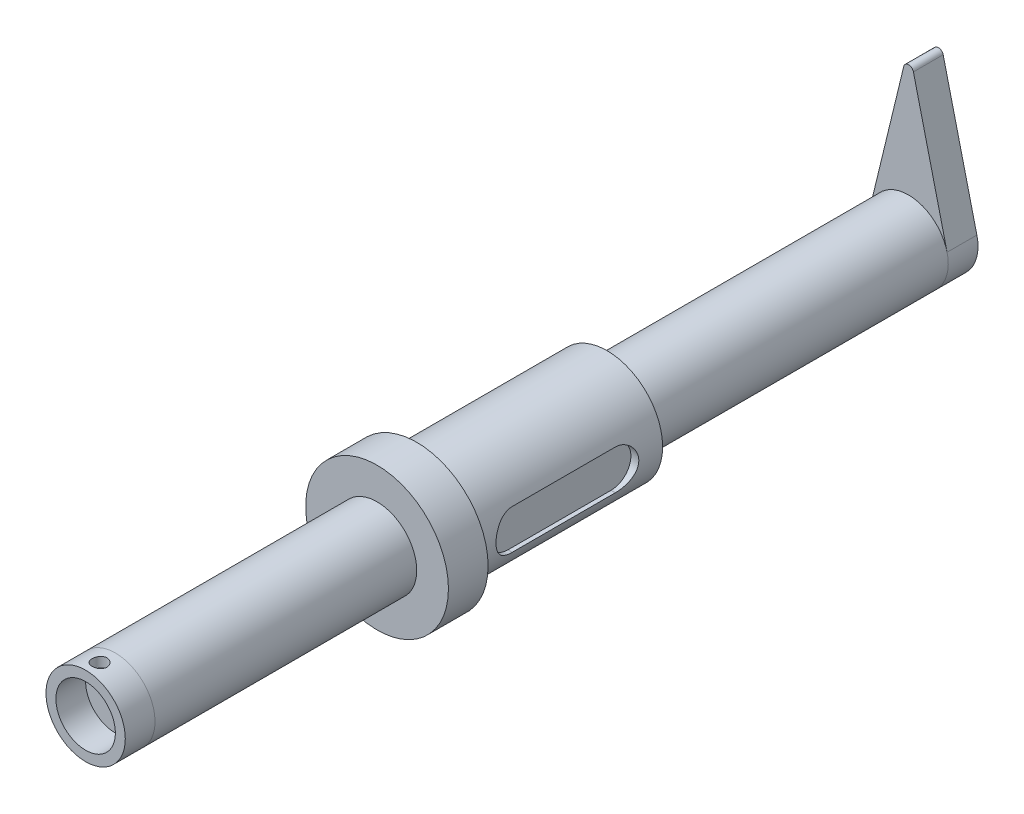
ISO-10303-21;
HEADER;
FILE_DESCRIPTION(('STEP AP214'),'2;1');
FILE_NAME('part.step','',(''),(''),'','','');
FILE_SCHEMA(('AUTOMOTIVE_DESIGN { 1 0 10303 214 1 1 1 1 }'));
ENDSEC;
DATA;
#1=APPLICATION_CONTEXT('core data for automotive mechanical design processes');
#2=APPLICATION_PROTOCOL_DEFINITION('international standard','automotive_design',2000,#1);
#3=PRODUCT_CONTEXT('',#1,'mechanical');
#4=PRODUCT('Part','Part','',(#3));
#5=PRODUCT_RELATED_PRODUCT_CATEGORY('part','',(#4));
#6=PRODUCT_DEFINITION_FORMATION('','',#4);
#7=PRODUCT_DEFINITION_CONTEXT('part definition',#1,'design');
#8=PRODUCT_DEFINITION('design','',#6,#7);
#9=PRODUCT_DEFINITION_SHAPE('','',#8);
#10=(LENGTH_UNIT() NAMED_UNIT(*) SI_UNIT(.MILLI.,.METRE.));
#11=(NAMED_UNIT(*) PLANE_ANGLE_UNIT() SI_UNIT($,.RADIAN.));
#12=(NAMED_UNIT(*) SI_UNIT($,.STERADIAN.) SOLID_ANGLE_UNIT());
#13=UNCERTAINTY_MEASURE_WITH_UNIT(LENGTH_MEASURE(1.E-05),#10,'distance_accuracy_value','');
#14=(GEOMETRIC_REPRESENTATION_CONTEXT(3) GLOBAL_UNCERTAINTY_ASSIGNED_CONTEXT((#13)) GLOBAL_UNIT_ASSIGNED_CONTEXT((#10,
#11,#12)) REPRESENTATION_CONTEXT('',''));
#15=CARTESIAN_POINT('',(0.,0.,0.));
#16=DIRECTION('',(0.,0.,1.));
#17=DIRECTION('',(1.,0.,0.));
#18=AXIS2_PLACEMENT_3D('',#15,#16,#17);
#19=CARTESIAN_POINT('',(0.,0.,43.2436302302761));
#20=DIRECTION('',(0.,0.,-1.));
#21=DIRECTION('',(-1.,0.,0.));
#22=AXIS2_PLACEMENT_3D('',#19,#20,#21);
#23=CYLINDRICAL_SURFACE('',#22,4.);
#24=CARTESIAN_POINT('',(0.,0.,43.2436302302761));
#25=DIRECTION('',(0.,0.,1.));
#26=DIRECTION('',(1.,0.,0.));
#27=AXIS2_PLACEMENT_3D('',#24,#25,#26);
#28=CIRCLE('',#27,4.);
#29=CARTESIAN_POINT('',(4.,0.,43.2436302302761));
#30=VERTEX_POINT('',#29);
#31=EDGE_CURVE('E165',#30,#30,#28,.T.);
#32=ORIENTED_EDGE('',*,*,#31,.F.);
#33=EDGE_LOOP('',(#32));
#34=FACE_BOUND('',#33,.T.);
#35=CARTESIAN_POINT('',(0.,0.,40.2436302302761));
#36=DIRECTION('',(0.,0.,1.));
#37=DIRECTION('',(-0.00112918157534551,-0.999999362474282,0.));
#38=AXIS2_PLACEMENT_3D('',#35,#36,#37);
#39=CIRCLE('',#38,4.);
#40=CARTESIAN_POINT('',(-0.00451672630138206,-3.99999744989713,40.2436302302761));
#41=VERTEX_POINT('',#40);
#42=EDGE_CURVE('E182',#41,#41,#39,.T.);
#43=ORIENTED_EDGE('',*,*,#42,.T.);
#44=EDGE_LOOP('',(#43));
#45=FACE_BOUND('',#44,.T.);
#46=CARTESIAN_POINT('',(0.,4.,41.0927864145834));
#47=CARTESIAN_POINT('',(-0.0417358732327354,3.99999924416926,41.0927880093775));
#48=CARTESIAN_POINT('',(-0.083492496365049,3.99934004960857,41.0962819528931));
#49=CARTESIAN_POINT('',(-0.165829064920899,3.9967739294526,41.1101564121425));
#50=CARTESIAN_POINT('',(-0.206407987076113,3.99486595083448,41.1205427399032));
#51=CARTESIAN_POINT('',(-0.285186480925901,3.99001569382729,41.147872765213));
#52=CARTESIAN_POINT('',(-0.323388165342672,3.98707434973241,41.1648105408096));
#53=CARTESIAN_POINT('',(-0.396403986547004,3.98047855299892,41.2047458530448));
#54=CARTESIAN_POINT('',(-0.431218397238663,3.97682415809145,41.2277428991558));
#55=CARTESIAN_POINT('',(-0.496891857965253,3.96915668215252,41.2794362985852));
#56=CARTESIAN_POINT('',(-0.527704477515916,3.96514017428176,41.3081911369184));
#57=CARTESIAN_POINT('',(-0.584098030676845,3.95722659229325,41.3704580691271));
#58=CARTESIAN_POINT('',(-0.609678588446206,3.95332952677264,41.403970504468));
#59=CARTESIAN_POINT('',(-0.655074993328964,3.94606275622503,41.4751294587653));
#60=CARTESIAN_POINT('',(-0.674843609848028,3.94269746943091,41.512806599742));
#61=CARTESIAN_POINT('',(-0.707752621661417,3.93692356605994,41.5910208721718));
#62=CARTESIAN_POINT('',(-0.720893588565492,3.93451486698481,41.631557756639));
#63=CARTESIAN_POINT('',(-0.740025267517501,3.93096134787275,41.7138440300406));
#64=CARTESIAN_POINT('',(-0.746096950960195,3.92980222683202,41.7555739631851));
#65=CARTESIAN_POINT('',(-0.751169040476732,3.92883598576381,41.8394751069875));
#66=CARTESIAN_POINT('',(-0.75017008067687,3.9290287444938,41.8816462777345));
#67=CARTESIAN_POINT('',(-0.741194898011812,3.93073146350876,41.9646461772164));
#68=CARTESIAN_POINT('',(-0.733310749980225,3.93222404073667,42.0054852717334));
#69=CARTESIAN_POINT('',(-0.710933996981035,3.93633091642333,42.0852506244747));
#70=CARTESIAN_POINT('',(-0.696441111197496,3.93894526254758,42.124176801338));
#71=CARTESIAN_POINT('',(-0.661168235896499,3.94501927646294,42.1992807540835));
#72=CARTESIAN_POINT('',(-0.640351067662281,3.94848391911683,42.2354406498738));
#73=CARTESIAN_POINT('',(-0.593046844652082,3.95586485801459,42.3037887788535));
#74=CARTESIAN_POINT('',(-0.566559214446329,3.95978120007761,42.3359766084408));
#75=CARTESIAN_POINT('',(-0.508169528426487,3.96770000636082,42.3959988924196));
#76=CARTESIAN_POINT('',(-0.476188718430342,3.97170285512015,42.4237567408092));
#77=CARTESIAN_POINT('',(-0.407984018549415,3.97928693054159,42.4735250349211));
#78=CARTESIAN_POINT('',(-0.371760086127885,3.98286815297623,42.4955354230186));
#79=CARTESIAN_POINT('',(-0.296017494437333,3.98921269838754,42.5331952915184));
#80=CARTESIAN_POINT('',(-0.256494782223246,3.99197499568144,42.5488368041423));
#81=CARTESIAN_POINT('',(-0.175319557699348,3.9963625270136,42.5732374611294));
#82=CARTESIAN_POINT('',(-0.133667272138892,3.99798788183997,42.581997336606));
#83=CARTESIAN_POINT('',(-0.0500743264516913,3.9999018032099,42.5922794300925));
#84=CARTESIAN_POINT('',(-0.00814700631706651,4.00020975456139,42.5939066103482));
#85=CARTESIAN_POINT('',(0.0753806240460931,3.99950771799114,42.5901586748095));
#86=CARTESIAN_POINT('',(0.116980950240194,3.99849779482216,42.5847839030507));
#87=CARTESIAN_POINT('',(0.19834078660911,3.99528555750203,42.5672718969917));
#88=CARTESIAN_POINT('',(0.238112130523033,3.99309261187015,42.5551877733145));
#89=CARTESIAN_POINT('',(0.315064315912318,3.98775921106249,42.524657561194));
#90=CARTESIAN_POINT('',(0.352244981297553,3.98461869155667,42.5062110408005));
#91=CARTESIAN_POINT('',(0.423408335756608,3.97769015178833,42.4632473505036));
#92=CARTESIAN_POINT('',(0.457351638507561,3.97389543087281,42.4386660453149));
#93=CARTESIAN_POINT('',(0.520669161632272,3.96609671744856,42.3842173459022));
#94=CARTESIAN_POINT('',(0.550042954880434,3.96209270542343,42.3543494580827));
#95=CARTESIAN_POINT('',(0.60378647936024,3.95426237848725,42.2897002551276));
#96=CARTESIAN_POINT('',(0.628084581092883,3.95043912930128,42.2548589605207));
#97=CARTESIAN_POINT('',(0.670483375288935,3.94346492789266,42.1815276023215));
#98=CARTESIAN_POINT('',(0.688584298069622,3.94031395068675,42.1430376743981));
#99=CARTESIAN_POINT('',(0.717973367564116,3.93506512104787,42.0636834809621));
#100=CARTESIAN_POINT('',(0.729294343973932,3.93296220218439,42.0228317248037));
#101=CARTESIAN_POINT('',(0.744903396631178,3.93003601901208,41.9397628033227));
#102=CARTESIAN_POINT('',(0.749192266353541,3.92921261032895,41.8975457925982));
#103=CARTESIAN_POINT('',(0.750588810741773,3.92894599901929,41.8136622488626));
#104=CARTESIAN_POINT('',(0.747809475017494,3.92948107987147,41.7719976241049));
#105=CARTESIAN_POINT('',(0.735395876894015,3.93182300329999,41.6897407035607));
#106=CARTESIAN_POINT('',(0.72576165544666,3.93362983827873,41.6491484013696));
#107=CARTESIAN_POINT('',(0.699959437916316,3.9383025401159,41.5702491721856));
#108=CARTESIAN_POINT('',(0.683803676986262,3.94116642297482,41.5319381189105));
#109=CARTESIAN_POINT('',(0.645429344561021,3.9476319377592,41.4585522874629));
#110=CARTESIAN_POINT('',(0.623210344740928,3.9512336218006,41.423477738161));
#111=CARTESIAN_POINT('',(0.572947436697675,3.95883633053873,41.3569945745622));
#112=CARTESIAN_POINT('',(0.544821299321517,3.96284252676522,41.3256487082998));
#113=CARTESIAN_POINT('',(0.483713963371147,3.97076416959367,41.2680838333511));
#114=CARTESIAN_POINT('',(0.45073165094581,3.97467959513664,41.2418660040933));
#115=CARTESIAN_POINT('',(0.380492472535939,3.98201987984024,41.1950809382698));
#116=CARTESIAN_POINT('',(0.34319979532026,3.98544000495281,41.174566700338));
#117=CARTESIAN_POINT('',(0.265645056826916,3.99135809690343,41.1401275962808));
#118=CARTESIAN_POINT('',(0.225385825852621,3.99385692939519,41.1261965410599));
#119=CARTESIAN_POINT('',(0.154173601412574,3.99714145353816,41.108147757374));
#120=CARTESIAN_POINT('',(0.123636905125934,3.99820735439103,41.102397099427));
#121=CARTESIAN_POINT('',(0.0620706235575784,3.99963689977005,41.0947158835251));
#122=CARTESIAN_POINT('',(0.0310410508263544,4.00000056214902,41.0927852284554));
#123=CARTESIAN_POINT('',(0.,4.,41.0927864145834));
#124=B_SPLINE_CURVE_WITH_KNOTS('',3,(#46,#47,#48,#49,#50,#51,#52,#53,#54,#55,#56,#57,#58,#59,
#60,#61,#62,#63,#64,#65,#66,#67,#68,#69,#70,#71,#72,#73,#74,#75,#76,#77,#78,#79,#80,#81,#82,#83,
#84,#85,#86,#87,#88,#89,#90,#91,#92,#93,#94,#95,#96,#97,#98,#99,#100,#101,#102,#103,#104,#105,
#106,#107,#108,#109,#110,#111,#112,#113,#114,#115,#116,#117,#118,#119,#120,#121,#122,#123),
.UNSPECIFIED.,.T.,.F.,(4,2,2,2,2,2,2,2,2,2,2,2,2,2,2,2,2,2,2,2,2,2,2,2,2,2,2,2,2,2,2,2,2,2,2,2,
2,2,4),(0.,0.125094100482462,0.250293821267726,0.375380635615454,0.500457326684454,
0.626875590068151,0.753302931418083,0.88073095252179,1.00814798155974,1.13409075722668,
1.26002223793628,1.38429500306383,1.50857304923393,1.63359631314765,1.7586322702493,
1.88563884232038,2.01264668772474,2.1398129416085,2.26696568336873,2.39224087038049,
2.51750990232292,2.64180116953914,2.76610087669016,2.89175889008854,3.01742864206549,
3.1447671849365,3.27210099477473,3.3988131390928,3.52551098473257,3.65019626115875,
3.77488079270753,3.89933248103846,4.02379296327712,4.1501168498319,4.27646975631128,
4.40396024458158,4.53133063465587,4.62437172262205,4.7174104451977),.UNSPECIFIED.);
#125=CARTESIAN_POINT('',(0.,4.,41.0927864145834));
#126=VERTEX_POINT('',#125);
#127=EDGE_CURVE('E289',#126,#126,#124,.T.);
#128=ORIENTED_EDGE('',*,*,#127,.F.);
#129=EDGE_LOOP('',(#128));
#130=FACE_BOUND('',#129,.T.);
#131=ADVANCED_FACE('F43',(#34,#45,#130),#23,.T.);
#132=CARTESIAN_POINT('',(0.,0.,43.2436302302761));
#133=DIRECTION('',(0.,0.,-1.));
#134=DIRECTION('',(-1.,0.,0.));
#135=AXIS2_PLACEMENT_3D('',#132,#133,#134);
#136=CYLINDRICAL_SURFACE('',#135,3.);
#137=CARTESIAN_POINT('',(0.,0.,40.2436302302761));
#138=DIRECTION('',(0.,0.,1.));
#139=DIRECTION('',(1.,0.,0.));
#140=AXIS2_PLACEMENT_3D('',#137,#138,#139);
#141=CIRCLE('',#140,3.);
#142=CARTESIAN_POINT('',(3.,0.,40.2436302302761));
#143=VERTEX_POINT('',#142);
#144=EDGE_CURVE('E11',#143,#143,#141,.F.);
#145=ORIENTED_EDGE('',*,*,#144,.T.);
#146=EDGE_LOOP('',(#145));
#147=FACE_BOUND('',#146,.T.);
#148=CARTESIAN_POINT('',(0.,0.,43.2436302302761));
#149=DIRECTION('',(0.,0.,1.));
#150=DIRECTION('',(1.,0.,0.));
#151=AXIS2_PLACEMENT_3D('',#148,#149,#150);
#152=CIRCLE('',#151,3.);
#153=CARTESIAN_POINT('',(3.,0.,43.2436302302761));
#154=VERTEX_POINT('',#153);
#155=EDGE_CURVE('E296',#154,#154,#152,.T.);
#156=ORIENTED_EDGE('',*,*,#155,.T.);
#157=EDGE_LOOP('',(#156));
#158=FACE_BOUND('',#157,.T.);
#159=CARTESIAN_POINT('',(0.,3.,41.0927864145834));
#160=CARTESIAN_POINT('',(-0.0414380443348658,2.99999929934006,41.0927875774524));
#161=CARTESIAN_POINT('',(-0.0828890789153821,2.99913289065914,41.0962321899703));
#162=CARTESIAN_POINT('',(-0.164603161885267,2.99576056914946,41.1098989902369));
#163=CARTESIAN_POINT('',(-0.20486552343537,2.99325372709984,41.1201250193523));
#164=CARTESIAN_POINT('',(-0.283010436091289,2.9868781316602,41.1470060413144));
#165=CARTESIAN_POINT('',(-0.320895781715002,2.98301101421043,41.163653313941));
#166=CARTESIAN_POINT('',(-0.393336065952214,2.97432671903797,41.2028771096058));
#167=CARTESIAN_POINT('',(-0.42789089217438,2.96950950927025,41.2254538326428));
#168=CARTESIAN_POINT('',(-0.49340096365046,2.95933706795901,41.2763868094105));
#169=CARTESIAN_POINT('',(-0.524277845030536,2.95397353574267,41.304842202063));
#170=CARTESIAN_POINT('',(-0.580874463601652,2.94336810058765,41.3665125170378));
#171=CARTESIAN_POINT('',(-0.606593618474567,2.93812621144174,41.3997279760566));
#172=CARTESIAN_POINT('',(-0.652513271399515,2.92827387849855,41.4705840279521));
#173=CARTESIAN_POINT('',(-0.672626107962677,2.92367397235303,41.5082830299886));
#174=CARTESIAN_POINT('',(-0.706198454275263,2.91574747406112,41.5866606204125));
#175=CARTESIAN_POINT('',(-0.719659027719667,2.91242067836394,41.6273387312462));
#176=CARTESIAN_POINT('',(-0.739277418402146,2.90750238358775,41.7096581636846));
#177=CARTESIAN_POINT('',(-0.74557613416667,2.90587745537713,41.7512638626083));
#178=CARTESIAN_POINT('',(-0.751130887533926,2.90444681268871,41.8349706990904));
#179=CARTESIAN_POINT('',(-0.750388070908989,2.90464080224322,41.8770717549327));
#180=CARTESIAN_POINT('',(-0.741993262319641,2.90679602748309,41.9594943184556));
#181=CARTESIAN_POINT('',(-0.734509170095261,2.9087143150094,41.9998342253159));
#182=CARTESIAN_POINT('',(-0.713112093451553,2.91403354838242,42.078666940039));
#183=CARTESIAN_POINT('',(-0.699198651034711,2.91743459985348,42.1171596160979));
#184=CARTESIAN_POINT('',(-0.665194738968577,2.92537556952093,42.1916554227094));
#185=CARTESIAN_POINT('',(-0.645043333616456,2.92992663734711,42.2276295004781));
#186=CARTESIAN_POINT('',(-0.599178138007477,2.93964855423193,42.2957457694618));
#187=CARTESIAN_POINT('',(-0.573463374404419,2.94481951167368,42.327887288617));
#188=CARTESIAN_POINT('',(-0.516331712340608,2.95537940269891,42.3883882224306));
#189=CARTESIAN_POINT('',(-0.484773129082931,2.96077034738986,42.416613659614));
#190=CARTESIAN_POINT('',(-0.417305958751851,2.97102982789393,42.4673970358153));
#191=CARTESIAN_POINT('',(-0.381397238853971,2.97589834774708,42.4899548017151));
#192=CARTESIAN_POINT('',(-0.306057944340693,2.98458866047091,42.5288117076956));
#193=CARTESIAN_POINT('',(-0.26661569660431,2.98840680063863,42.5450890847106));
#194=CARTESIAN_POINT('',(-0.185438004071439,2.99453958495709,42.5707450674381));
#195=CARTESIAN_POINT('',(-0.14370299957524,2.99685451669641,42.5801249927924));
#196=CARTESIAN_POINT('',(-0.0602699851950113,2.99967749635687,42.5915151973628));
#197=CARTESIAN_POINT('',(-0.0185983599941032,3.00023026754139,42.593707927621));
#198=CARTESIAN_POINT('',(0.0645164374007551,2.99959402407225,42.5911619135556));
#199=CARTESIAN_POINT('',(0.105959629822299,2.99840516620923,42.5864237931838));
#200=CARTESIAN_POINT('',(0.186807134388247,2.99444790563679,42.5703009603877));
#201=CARTESIAN_POINT('',(0.226232559484379,2.99170317092906,42.5590157828449));
#202=CARTESIAN_POINT('',(0.302628646226258,2.98494353317067,42.5302328725691));
#203=CARTESIAN_POINT('',(0.33959905951632,2.98092850184946,42.5127345124268));
#204=CARTESIAN_POINT('',(0.410761567214926,2.97196653963155,42.471668350146));
#205=CARTESIAN_POINT('',(0.444892720917916,2.96700433683466,42.447998358385));
#206=CARTESIAN_POINT('',(0.508763306821623,2.9567225459371,42.3953914601849));
#207=CARTESIAN_POINT('',(0.538501979486506,2.95140289625852,42.3664536447749));
#208=CARTESIAN_POINT('',(0.593495284036368,2.94084478480386,42.3032854341611));
#209=CARTESIAN_POINT('',(0.618621933811018,2.9356115209364,42.2689425630821));
#210=CARTESIAN_POINT('',(0.66275537950635,2.92596439188619,42.1964200973505));
#211=CARTESIAN_POINT('',(0.681762447078969,2.92155049033513,42.1582406731035));
#212=CARTESIAN_POINT('',(0.712975710304647,2.91409047367333,42.0793335533768));
#213=CARTESIAN_POINT('',(0.725222198327034,2.91103627645953,42.0386226004114));
#214=CARTESIAN_POINT('',(0.74267282997689,2.90663372045092,41.9556315956388));
#215=CARTESIAN_POINT('',(0.747878513739329,2.90528498859968,41.9133518890671));
#216=CARTESIAN_POINT('',(0.751019295166997,2.90447450601978,41.8297259026558));
#217=CARTESIAN_POINT('',(0.749158948890059,2.90495966364132,41.788387697021));
#218=CARTESIAN_POINT('',(0.738688639156434,2.90763954503921,41.7066344702494));
#219=CARTESIAN_POINT('',(0.730078811343386,2.90983423445928,41.6662194305765));
#220=CARTESIAN_POINT('',(0.706465659721398,2.91565630341361,41.5876821850507));
#221=CARTESIAN_POINT('',(0.691500702340188,2.91927507618155,41.5495477619633));
#222=CARTESIAN_POINT('',(0.655632456802535,2.92753877862414,41.4763037232265));
#223=CARTESIAN_POINT('',(0.634728345017094,2.93218385060387,41.4411945279899));
#224=CARTESIAN_POINT('',(0.586933874318567,2.94212817131756,41.3740091000823));
#225=CARTESIAN_POINT('',(0.559901581456125,2.94744132415879,41.3420358778714));
#226=CARTESIAN_POINT('',(0.500894685594866,2.95804013623143,41.2830128921857));
#227=CARTESIAN_POINT('',(0.468918910630573,2.9633257886353,41.2559642995269));
#228=CARTESIAN_POINT('',(0.400233793351297,2.97338827823831,41.2070807603011));
#229=CARTESIAN_POINT('',(0.363449211158195,2.97815416682934,41.1853491077476));
#230=CARTESIAN_POINT('',(0.286633029755239,2.98652462487559,41.1484126831131));
#231=CARTESIAN_POINT('',(0.24660378171837,2.99013002599891,41.1332032342591));
#232=CARTESIAN_POINT('',(0.172205126621735,2.99524029782771,41.1120004994185));
#233=CARTESIAN_POINT('',(0.138190085454033,2.99701292526345,41.1048107930567));
#234=CARTESIAN_POINT('',(0.0694530357681406,2.99939302615974,41.0952034427724));
#235=CARTESIAN_POINT('',(0.0347310806213077,3.00000058725447,41.0927854399307));
#236=CARTESIAN_POINT('',(0.,3.,41.0927864145834));
#237=B_SPLINE_CURVE_WITH_KNOTS('',3,(#159,#160,#161,#162,#163,#164,#165,#166,#167,#168,#169,
#170,#171,#172,#173,#174,#175,#176,#177,#178,#179,#180,#181,#182,#183,#184,#185,#186,#187,#188,
#189,#190,#191,#192,#193,#194,#195,#196,#197,#198,#199,#200,#201,#202,#203,#204,#205,#206,#207,
#208,#209,#210,#211,#212,#213,#214,#215,#216,#217,#218,#219,#220,#221,#222,#223,#224,#225,#226,
#227,#228,#229,#230,#231,#232,#233,#234,#235,#236),.UNSPECIFIED.,.T.,.F.,(4,2,2,2,2,2,2,2,2,2,2,
2,2,2,2,2,2,2,2,2,2,2,2,2,2,2,2,2,2,2,2,2,2,2,2,2,2,2,4),(0.,0.124186856235946,0.24844411888195,
0.372552451143054,0.496664970084664,0.623072177185693,0.749493647900307,0.877793237729033,
1.00607230584684,1.13178147549715,1.25747019056348,1.38011248503509,1.50276351733019,
1.6266526393694,1.75056345418081,1.87800750484509,2.00545544779124,2.13334114504557,
2.26120236844321,2.38579154474638,2.51036950556371,2.63310137257019,2.75584563661145,
2.88076793782676,3.00571181504009,3.13372254602238,3.26172759374754,3.38896127307019,
3.51616711626204,3.63971890199306,3.76326820478017,3.88608200279723,4.00891284068451,
4.13494788204955,4.26101284885208,4.38936092749793,4.51761681910675,4.62171121471074,
4.72579778021519),.UNSPECIFIED.);
#238=CARTESIAN_POINT('',(0.,3.,41.0927864145834));
#239=VERTEX_POINT('',#238);
#240=EDGE_CURVE('E47',#239,#239,#237,.T.);
#241=ORIENTED_EDGE('',*,*,#240,.T.);
#242=EDGE_LOOP('',(#241));
#243=FACE_BOUND('',#242,.T.);
#244=ADVANCED_FACE('F264',(#147,#158,#243),#136,.F.);
#245=CARTESIAN_POINT('',(-0.00891774261922876,1.28985864549494E-07,9.8436302302761));
#246=DIRECTION('',(0.,0.,-1.));
#247=DIRECTION('',(-1.,0.,0.));
#248=AXIS2_PLACEMENT_3D('',#245,#246,#247);
#249=CYLINDRICAL_SURFACE('',#248,5.6);
#250=DIRECTION('',(0.,0.,-1.));
#251=VECTOR('',#250,1.);
#252=CARTESIAN_POINT('',(5.22176098962958,2.00000012898587,9.8436302302761));
#253=LINE('',#252,#251);
#254=CARTESIAN_POINT('',(5.22176098962958,2.00000012898587,5.4436302302761));
#255=VERTEX_POINT('',#254);
#256=CARTESIAN_POINT('',(5.22176098962958,2.00000012898587,-4.9563697697239));
#257=VERTEX_POINT('',#256);
#258=EDGE_CURVE('E171',#255,#257,#253,.T.);
#259=ORIENTED_EDGE('',*,*,#258,.T.);
#260=CARTESIAN_POINT('',(5.22176098962958,2.00000012898587,-4.9563697697239));
#261=CARTESIAN_POINT('',(5.22175148766183,2.0000075867531,-5.01068116630704));
#262=CARTESIAN_POINT('',(5.22260665676268,1.99778800959942,-5.06498731583517));
#263=CARTESIAN_POINT('',(5.22597551720584,1.98895294593115,-5.17317289821303));
#264=CARTESIAN_POINT('',(5.22848870072527,1.98233880539553,-5.2270524566088));
#265=CARTESIAN_POINT('',(5.23509199848431,1.96480153127306,-5.33382690140613));
#266=CARTESIAN_POINT('',(5.23917691102618,1.95389260869751,-5.38672443879575));
#267=CARTESIAN_POINT('',(5.24878768021417,1.92788105271905,-5.49133123781068));
#268=CARTESIAN_POINT('',(5.25431360058674,1.91277823384535,-5.54304044677384));
#269=CARTESIAN_POINT('',(5.27280173230645,1.8613918424195,-5.69578126290591));
#270=CARTESIAN_POINT('',(5.28768606010753,1.81900102984175,-5.79460213143236));
#271=CARTESIAN_POINT('',(5.32088543626645,1.71928619190927,-5.98375403622628));
#272=CARTESIAN_POINT('',(5.33920298077978,1.66195128937666,-6.07407882311232));
#273=CARTESIAN_POINT('',(5.37812156771856,1.53122069780163,-6.24774194040607));
#274=CARTESIAN_POINT('',(5.39878516971174,1.45726682615982,-6.3306469498806));
#275=CARTESIAN_POINT('',(5.43954299596502,1.29658723919651,-6.48317673349704));
#276=CARTESIAN_POINT('',(5.45963711353971,1.20985914940725,-6.55279903311858));
#277=CARTESIAN_POINT('',(5.49773132361314,1.02283145167334,-6.67884165408789));
#278=CARTESIAN_POINT('',(5.51564893917114,0.922198799299348,-6.73479498721233));
#279=CARTESIAN_POINT('',(5.54662111876184,0.712200789367175,-6.82879908716182));
#280=CARTESIAN_POINT('',(5.55967735006449,0.602838441418128,-6.86685599296071));
#281=CARTESIAN_POINT('',(5.57901066146646,0.383064112390807,-6.92248225146979));
#282=CARTESIAN_POINT('',(5.58553501220089,0.27286399716784,-6.94080107410076));
#283=CARTESIAN_POINT('',(5.59195264181135,0.0507715732233893,-6.95882449194601));
#284=CARTESIAN_POINT('',(5.59184775580239,-0.0611202586200921,-6.95853423855162));
#285=CARTESIAN_POINT('',(5.58518032177339,-0.27807447780369,-6.939800750715));
#286=CARTESIAN_POINT('',(5.5789082060489,-0.38321779667711,-6.92217393436508));
#287=CARTESIAN_POINT('',(5.56098491743955,-0.588940520729019,-6.87063103039686));
#288=CARTESIAN_POINT('',(5.54933344057307,-0.689519667638505,-6.83671402223388));
#289=CARTESIAN_POINT('',(5.52161431250372,-0.884928690452592,-6.75313224047164));
#290=CARTESIAN_POINT('',(5.50548699469528,-0.979658103549383,-6.7032531977558));
#291=CARTESIAN_POINT('',(5.47046910231133,-1.15962812145832,-6.58934630154521));
#292=CARTESIAN_POINT('',(5.45157768905488,-1.2448658324283,-6.52531415069702));
#293=CARTESIAN_POINT('',(5.41180663982469,-1.40825943306269,-6.38091115879854));
#294=CARTESIAN_POINT('',(5.39087470413177,-1.48579335661748,-6.29984999120798));
#295=CARTESIAN_POINT('',(5.35020499713257,-1.62639918798451,-6.12570787839144));
#296=CARTESIAN_POINT('',(5.33046765550283,-1.68946591466583,-6.03262264558912));
#297=CARTESIAN_POINT('',(5.29410468838401,-1.8003987582018,-5.83481569090632));
#298=CARTESIAN_POINT('',(5.27754525833273,-1.84795353493114,-5.72990658931957));
#299=CARTESIAN_POINT('',(5.25018796626291,-1.92444338882093,-5.51287792845815));
#300=CARTESIAN_POINT('',(5.2393807147012,-1.95340882621377,-5.40077045678871));
#301=CARTESIAN_POINT('',(5.22875059534527,-1.98164384820315,-5.23234533431253));
#302=CARTESIAN_POINT('',(5.22613834512403,-1.9885226517057,-5.17738072830647));
#303=CARTESIAN_POINT('',(5.22264154401818,-1.99769868841319,-5.06707763837055));
#304=CARTESIAN_POINT('',(5.22175508250825,-2.00000098833707,-5.01173963604349));
#305=CARTESIAN_POINT('',(5.22176098962958,-1.99999987101413,-4.9563697697239));
#306=B_SPLINE_CURVE_WITH_KNOTS('',3,(#260,#261,#262,#263,#264,#265,#266,#267,#268,#269,#270,
#271,#272,#273,#274,#275,#276,#277,#278,#279,#280,#281,#282,#283,#284,#285,#286,#287,#288,#289,
#290,#291,#292,#293,#294,#295,#296,#297,#298,#299,#300,#301,#302,#303,#304,#305),.UNSPECIFIED.,
.F.,.F.,(4,2,2,2,2,2,2,2,2,2,2,2,2,2,2,2,2,2,2,2,2,2,4),(0.,0.162873302841272,0.325696743380423,
0.487985885236594,0.650282205308792,0.974344948444097,1.29864422518776,1.63612777849544,
1.97367414249472,2.32150719172449,2.6692208373219,3.00320795152689,3.33710261133538,
3.65599136689078,3.9748981446951,4.29827927558912,4.62175873094338,4.96252670356071,
5.30341652539777,5.65077863246804,5.99757197193956,6.16374864130218,6.32974123117123),.UNSPECIFIED.);
#307=CARTESIAN_POINT('',(5.22176098962958,-1.99999987101413,-4.9563697697239));
#308=VERTEX_POINT('',#307);
#309=EDGE_CURVE('E230',#257,#308,#306,.T.);
#310=ORIENTED_EDGE('',*,*,#309,.T.);
#311=DIRECTION('',(0.,0.,-1.));
#312=VECTOR('',#311,1.);
#313=CARTESIAN_POINT('',(5.22176098962958,-1.99999987101414,9.8436302302761));
#314=LINE('',#313,#312);
#315=CARTESIAN_POINT('',(5.22176098962958,-1.99999987101414,5.4436302302761));
#316=VERTEX_POINT('',#315);
#317=EDGE_CURVE('E217',#308,#316,#314,.F.);
#318=ORIENTED_EDGE('',*,*,#317,.T.);
#319=CARTESIAN_POINT('',(5.22176098962958,-1.99999987101414,5.4436302302761));
#320=CARTESIAN_POINT('',(5.22175148766183,-2.00000732878136,5.49794162685925));
#321=CARTESIAN_POINT('',(5.22260665676268,-1.99778775162769,5.55224777638737));
#322=CARTESIAN_POINT('',(5.22597551720584,-1.98895268795942,5.66043335876524));
#323=CARTESIAN_POINT('',(5.22848870072527,-1.9823385474238,5.71431291716101));
#324=CARTESIAN_POINT('',(5.23509199848431,-1.96480127330133,5.82108736195833));
#325=CARTESIAN_POINT('',(5.23917691102618,-1.95389235072577,5.87398489934795));
#326=CARTESIAN_POINT('',(5.24878768021417,-1.92788079474732,5.97859169836288));
#327=CARTESIAN_POINT('',(5.25431360058674,-1.91277797587362,6.03030090732604));
#328=CARTESIAN_POINT('',(5.27280173230645,-1.86139158444777,6.18304172345812));
#329=CARTESIAN_POINT('',(5.28768606010753,-1.81900077187002,6.28186259198456));
#330=CARTESIAN_POINT('',(5.32088543626645,-1.71928593393753,6.47101449677848));
#331=CARTESIAN_POINT('',(5.33920298077978,-1.66195103140493,6.56133928366453));
#332=CARTESIAN_POINT('',(5.37812156771856,-1.53122043982989,6.73500240095828));
#333=CARTESIAN_POINT('',(5.39878516971174,-1.45726656818809,6.81790741043281));
#334=CARTESIAN_POINT('',(5.43954299596502,-1.29658698122478,6.97043719404924));
#335=CARTESIAN_POINT('',(5.45963711353971,-1.20985889143552,7.04005949367079));
#336=CARTESIAN_POINT('',(5.49773132361314,-1.02283119370161,7.16610211464009));
#337=CARTESIAN_POINT('',(5.51564893917114,-0.922198541327615,7.22205544776454));
#338=CARTESIAN_POINT('',(5.54662111876184,-0.712200531395443,7.31605954771403));
#339=CARTESIAN_POINT('',(5.5596773500645,-0.602838183446396,7.35411645351291));
#340=CARTESIAN_POINT('',(5.57901066146646,-0.383063854419075,7.409742712022));
#341=CARTESIAN_POINT('',(5.58553501220089,-0.272863739196108,7.42806153465297));
#342=CARTESIAN_POINT('',(5.59195264181135,-0.0507713152516576,7.44608495249822));
#343=CARTESIAN_POINT('',(5.59184775580239,0.061120516591824,7.44579469910383));
#344=CARTESIAN_POINT('',(5.58518032177339,0.278074735775422,7.42706121126721));
#345=CARTESIAN_POINT('',(5.5789082060489,0.383218054648842,7.40943439491728));
#346=CARTESIAN_POINT('',(5.56098491743955,0.588940778700752,7.35789149094906));
#347=CARTESIAN_POINT('',(5.54933344057307,0.689519925610237,7.32397448278609));
#348=CARTESIAN_POINT('',(5.52161431250372,0.884928948424324,7.24039270102385));
#349=CARTESIAN_POINT('',(5.50548699469528,0.979658361521115,7.19051365830801));
#350=CARTESIAN_POINT('',(5.47046910231133,1.15962837943005,7.07660676209742));
#351=CARTESIAN_POINT('',(5.45157768905488,1.24486609040003,7.01257461124923));
#352=CARTESIAN_POINT('',(5.41180663982469,1.40825969103443,6.86817161935074));
#353=CARTESIAN_POINT('',(5.39087470413177,1.48579361458921,6.78711045176019));
#354=CARTESIAN_POINT('',(5.35020499713257,1.62639944595624,6.61296833894365));
#355=CARTESIAN_POINT('',(5.33046765550282,1.68946617263756,6.51988310614133));
#356=CARTESIAN_POINT('',(5.29410468838401,1.80039901617354,6.32207615145852));
#357=CARTESIAN_POINT('',(5.27754525833273,1.84795379290287,6.21716704987177));
#358=CARTESIAN_POINT('',(5.25018796626291,1.92444364679266,6.00013838901035));
#359=CARTESIAN_POINT('',(5.2393807147012,1.9534090841855,5.88803091734092));
#360=CARTESIAN_POINT('',(5.22875059534527,1.98164410617488,5.71960579486473));
#361=CARTESIAN_POINT('',(5.22613834512403,1.98852290967743,5.66464118885867));
#362=CARTESIAN_POINT('',(5.22264154401818,1.99769894638492,5.55433809892275));
#363=CARTESIAN_POINT('',(5.22175508250825,2.0000012463088,5.49900009659569));
#364=CARTESIAN_POINT('',(5.22176098962958,2.00000012898587,5.4436302302761));
#365=B_SPLINE_CURVE_WITH_KNOTS('',3,(#319,#320,#321,#322,#323,#324,#325,#326,#327,#328,#329,
#330,#331,#332,#333,#334,#335,#336,#337,#338,#339,#340,#341,#342,#343,#344,#345,#346,#347,#348,
#349,#350,#351,#352,#353,#354,#355,#356,#357,#358,#359,#360,#361,#362,#363,#364),.UNSPECIFIED.,
.F.,.F.,(4,2,2,2,2,2,2,2,2,2,2,2,2,2,2,2,2,2,2,2,2,2,4),(0.,0.162873302841273,0.325696743380424,
0.487985885236594,0.650282205308792,0.974344948444097,1.29864422518776,1.63612777849544,
1.97367414249472,2.32150719172449,2.6692208373219,3.00320795152689,3.33710261133538,
3.65599136689078,3.9748981446951,4.29827927558912,4.62175873094337,4.96252670356071,
5.30341652539777,5.65077863246804,5.99757197193956,6.16374864130219,6.32974123117123),.UNSPECIFIED.);
#366=EDGE_CURVE('E221',#316,#255,#365,.T.);
#367=ORIENTED_EDGE('',*,*,#366,.T.);
#368=EDGE_LOOP('',(#259,#310,#318,#367));
#369=FACE_BOUND('',#368,.T.);
#370=CARTESIAN_POINT('',(-0.00891774261922876,1.28985864549494E-07,9.8436302302761));
#371=DIRECTION('',(0.,0.,1.));
#372=DIRECTION('',(1.,0.,0.));
#373=AXIS2_PLACEMENT_3D('',#370,#371,#372);
#374=CIRCLE('',#373,5.6);
#375=CARTESIAN_POINT('',(5.59108225738077,1.28985864549494E-07,9.8436302302761));
#376=VERTEX_POINT('',#375);
#377=EDGE_CURVE('E329',#376,#376,#374,.T.);
#378=ORIENTED_EDGE('',*,*,#377,.F.);
#379=EDGE_LOOP('',(#378));
#380=FACE_BOUND('',#379,.T.);
#381=CARTESIAN_POINT('',(-0.00891774261922876,1.28985864549494E-07,-9.3563697697239));
#382=DIRECTION('',(0.,0.,1.));
#383=DIRECTION('',(1.,0.,0.));
#384=AXIS2_PLACEMENT_3D('',#381,#382,#383);
#385=CIRCLE('',#384,5.6);
#386=CARTESIAN_POINT('',(5.59108225738077,1.28985864549494E-07,-9.3563697697239));
#387=VERTEX_POINT('',#386);
#388=EDGE_CURVE('E407',#387,#387,#385,.T.);
#389=ORIENTED_EDGE('',*,*,#388,.T.);
#390=EDGE_LOOP('',(#389));
#391=FACE_BOUND('',#390,.T.);
#392=ADVANCED_FACE('F237',(#369,#380,#391),#249,.T.);
#393=CARTESIAN_POINT('',(-0.00891774261922876,1.28985864549494E-07,-9.3563697697239));
#394=DIRECTION('',(0.,0.,1.));
#395=DIRECTION('',(1.,0.,0.));
#396=AXIS2_PLACEMENT_3D('',#393,#394,#395);
#397=PLANE('',#396);
#398=CARTESIAN_POINT('',(-0.00891774261922876,1.28985864549494E-07,-9.3563697697239));
#399=DIRECTION('',(0.,0.,1.));
#400=DIRECTION('',(1.,0.,0.));
#401=AXIS2_PLACEMENT_3D('',#398,#399,#400);
#402=CIRCLE('',#401,4.);
#403=CARTESIAN_POINT('',(3.99108225738077,1.28985864549494E-07,-9.3563697697239));
#404=VERTEX_POINT('',#403);
#405=EDGE_CURVE('E411',#404,#404,#402,.T.);
#406=ORIENTED_EDGE('',*,*,#405,.T.);
#407=EDGE_LOOP('',(#406));
#408=FACE_BOUND('',#407,.T.);
#409=ORIENTED_EDGE('',*,*,#388,.F.);
#410=EDGE_LOOP('',(#409));
#411=FACE_BOUND('',#410,.T.);
#412=ADVANCED_FACE('F257',(#408,#411),#397,.F.);
#413=CARTESIAN_POINT('',(-0.00891774261922876,1.28985864549494E-07,40.2436302302761));
#414=DIRECTION('',(0.,0.,-1.));
#415=DIRECTION('',(-1.,0.,0.));
#416=AXIS2_PLACEMENT_3D('',#413,#414,#415);
#417=CYLINDRICAL_SURFACE('',#416,4.);
#418=CARTESIAN_POINT('',(-0.00891774261922876,1.28985864549494E-07,-39.7563697697239));
#419=DIRECTION('',(0.,0.,1.));
#420=DIRECTION('',(0.972072995611254,0.234678697804814,0.));
#421=AXIS2_PLACEMENT_3D('',#418,#419,#420);
#422=CIRCLE('',#421,4.);
#423=CARTESIAN_POINT('',(3.88332775454099,0.939873771797381,-39.7563697697239));
#424=VERTEX_POINT('',#423);
#425=CARTESIAN_POINT('',(-3.89223265085791,0.942281572301635,-39.7563697697239));
#426=VERTEX_POINT('',#425);
#427=EDGE_CURVE('E213',#424,#426,#422,.T.);
#428=ORIENTED_EDGE('',*,*,#427,.T.);
#429=CARTESIAN_POINT('',(0.,0.,-39.7563697697239));
#430=DIRECTION('',(0.,0.,-1.));
#431=DIRECTION('',(0.971924214227013,0.235294117646838,0.));
#432=AXIS2_PLACEMENT_3D('',#429,#430,#431);
#433=CIRCLE('',#432,3.99999999999625);
#434=EDGE_CURVE('E164',#424,#426,#433,.T.);
#435=ORIENTED_EDGE('',*,*,#434,.F.);
#436=EDGE_LOOP('',(#428,#435));
#437=FACE_BOUND('',#436,.T.);
#438=ORIENTED_EDGE('',*,*,#405,.F.);
#439=EDGE_LOOP('',(#438));
#440=FACE_BOUND('',#439,.T.);
#441=ADVANCED_FACE('F197',(#437,#440),#417,.T.);
#442=CARTESIAN_POINT('',(-0.00891774261922876,1.28985864549494E-07,13.8436302302761));
#443=DIRECTION('',(0.,0.,-1.));
#444=DIRECTION('',(-1.,0.,0.));
#445=AXIS2_PLACEMENT_3D('',#442,#443,#444);
#446=CYLINDRICAL_SURFACE('',#445,7.2);
#447=CARTESIAN_POINT('',(-0.00891774261922876,1.28985864549494E-07,13.8436302302761));
#448=DIRECTION('',(0.,0.,1.));
#449=DIRECTION('',(1.,0.,0.));
#450=AXIS2_PLACEMENT_3D('',#447,#448,#449);
#451=CIRCLE('',#450,7.2);
#452=CARTESIAN_POINT('',(7.19108225738077,1.28985864549494E-07,13.8436302302761));
#453=VERTEX_POINT('',#452);
#454=EDGE_CURVE('E396',#453,#453,#451,.T.);
#455=ORIENTED_EDGE('',*,*,#454,.F.);
#456=EDGE_LOOP('',(#455));
#457=FACE_BOUND('',#456,.T.);
#458=CARTESIAN_POINT('',(-0.00891774261922876,1.28985864549494E-07,9.8436302302761));
#459=DIRECTION('',(0.,0.,1.));
#460=DIRECTION('',(1.,0.,0.));
#461=AXIS2_PLACEMENT_3D('',#458,#459,#460);
#462=CIRCLE('',#461,7.2);
#463=CARTESIAN_POINT('',(7.19108225738077,1.28985864549494E-07,9.8436302302761));
#464=VERTEX_POINT('',#463);
#465=EDGE_CURVE('E392',#464,#464,#462,.T.);
#466=ORIENTED_EDGE('',*,*,#465,.T.);
#467=EDGE_LOOP('',(#466));
#468=FACE_BOUND('',#467,.T.);
#469=ADVANCED_FACE('F250',(#457,#468),#446,.T.);
#470=CARTESIAN_POINT('',(-0.00891774261922876,1.28985864549494E-07,13.8436302302761));
#471=DIRECTION('',(0.,0.,1.));
#472=DIRECTION('',(1.,0.,0.));
#473=AXIS2_PLACEMENT_3D('',#470,#471,#472);
#474=PLANE('',#473);
#475=CARTESIAN_POINT('',(-0.00891774261922876,1.28985864549494E-07,13.8436302302761));
#476=DIRECTION('',(0.,0.,1.));
#477=DIRECTION('',(1.,0.,0.));
#478=AXIS2_PLACEMENT_3D('',#475,#476,#477);
#479=CIRCLE('',#478,4.);
#480=CARTESIAN_POINT('',(3.99108225738077,1.28985864549494E-07,13.8436302302761));
#481=VERTEX_POINT('',#480);
#482=EDGE_CURVE('E400',#481,#481,#479,.T.);
#483=ORIENTED_EDGE('',*,*,#482,.F.);
#484=EDGE_LOOP('',(#483));
#485=FACE_BOUND('',#484,.T.);
#486=ORIENTED_EDGE('',*,*,#454,.T.);
#487=EDGE_LOOP('',(#486));
#488=FACE_BOUND('',#487,.T.);
#489=ADVANCED_FACE('F247',(#485,#488),#474,.T.);
#490=CARTESIAN_POINT('',(-0.00891774261922876,1.28985864549494E-07,9.8436302302761));
#491=DIRECTION('',(0.,0.,1.));
#492=DIRECTION('',(1.,0.,0.));
#493=AXIS2_PLACEMENT_3D('',#490,#491,#492);
#494=PLANE('',#493);
#495=ORIENTED_EDGE('',*,*,#377,.T.);
#496=EDGE_LOOP('',(#495));
#497=FACE_BOUND('',#496,.T.);
#498=ORIENTED_EDGE('',*,*,#465,.F.);
#499=EDGE_LOOP('',(#498));
#500=FACE_BOUND('',#499,.T.);
#501=ADVANCED_FACE('F195',(#497,#500),#494,.F.);
#502=ORIENTED_EDGE('',*,*,#482,.T.);
#503=EDGE_LOOP('',(#502));
#504=FACE_BOUND('',#503,.T.);
#505=ORIENTED_EDGE('',*,*,#42,.F.);
#506=EDGE_LOOP('',(#505));
#507=FACE_BOUND('',#506,.T.);
#508=ADVANCED_FACE('F185',(#504,#507),#417,.T.);
#509=CARTESIAN_POINT('',(4.79108225738077,1.28985864549494E-07,5.4436302302761));
#510=DIRECTION('',(1.,0.,0.));
#511=DIRECTION('',(0.,0.,-1.));
#512=AXIS2_PLACEMENT_3D('',#509,#510,#511);
#513=CYLINDRICAL_SURFACE('',#512,2.);
#514=DIRECTION('',(1.,0.,0.));
#515=VECTOR('',#514,1.);
#516=CARTESIAN_POINT('',(4.79108225738077,-1.99999987101414,5.4436302302761));
#517=LINE('',#516,#515);
#518=CARTESIAN_POINT('',(4.79108225738077,-1.99999987101414,5.4436302302761));
#519=VERTEX_POINT('',#518);
#520=EDGE_CURVE('E385',#519,#316,#517,.T.);
#521=ORIENTED_EDGE('',*,*,#520,.F.);
#522=CARTESIAN_POINT('',(4.79108225738077,1.28985864549494E-07,5.4436302302761));
#523=DIRECTION('',(1.,0.,0.));
#524=DIRECTION('',(0.,0.,-1.));
#525=AXIS2_PLACEMENT_3D('',#522,#523,#524);
#526=CIRCLE('',#525,2.);
#527=CARTESIAN_POINT('',(4.79108225738077,2.00000012898587,5.4436302302761));
#528=VERTEX_POINT('',#527);
#529=EDGE_CURVE('E142',#528,#519,#526,.T.);
#530=ORIENTED_EDGE('',*,*,#529,.F.);
#531=DIRECTION('',(1.,0.,0.));
#532=VECTOR('',#531,1.);
#533=CARTESIAN_POINT('',(4.79108225738077,2.00000012898587,5.4436302302761));
#534=LINE('',#533,#532);
#535=EDGE_CURVE('E374',#528,#255,#534,.T.);
#536=ORIENTED_EDGE('',*,*,#535,.T.);
#537=ORIENTED_EDGE('',*,*,#366,.F.);
#538=EDGE_LOOP('',(#521,#530,#536,#537));
#539=FACE_BOUND('',#538,.T.);
#540=ADVANCED_FACE('F194',(#539),#513,.F.);
#541=CARTESIAN_POINT('',(4.79108225738077,2.00000012898587,5.4436302302761));
#542=DIRECTION('',(0.,1.,0.));
#543=DIRECTION('',(0.,0.,1.));
#544=AXIS2_PLACEMENT_3D('',#541,#542,#543);
#545=PLANE('',#544);
#546=ORIENTED_EDGE('',*,*,#535,.F.);
#547=DIRECTION('',(0.,0.,1.));
#548=VECTOR('',#547,1.);
#549=CARTESIAN_POINT('',(4.79108225738077,2.00000012898587,5.4436302302761));
#550=LINE('',#549,#548);
#551=CARTESIAN_POINT('',(4.79108225738077,2.00000012898587,-4.9563697697239));
#552=VERTEX_POINT('',#551);
#553=EDGE_CURVE('E378',#552,#528,#550,.T.);
#554=ORIENTED_EDGE('',*,*,#553,.F.);
#555=DIRECTION('',(1.,0.,0.));
#556=VECTOR('',#555,1.);
#557=CARTESIAN_POINT('',(4.79108225738077,2.00000012898587,-4.9563697697239));
#558=LINE('',#557,#556);
#559=EDGE_CURVE('E366',#552,#257,#558,.T.);
#560=ORIENTED_EDGE('',*,*,#559,.T.);
#561=ORIENTED_EDGE('',*,*,#258,.F.);
#562=EDGE_LOOP('',(#546,#554,#560,#561));
#563=FACE_BOUND('',#562,.T.);
#564=ADVANCED_FACE('F244',(#563),#545,.F.);
#565=CARTESIAN_POINT('',(4.79108225738077,1.28985866459943E-07,-4.9563697697239));
#566=DIRECTION('',(1.,0.,0.));
#567=DIRECTION('',(0.,0.,-1.));
#568=AXIS2_PLACEMENT_3D('',#565,#566,#567);
#569=CYLINDRICAL_SURFACE('',#568,2.);
#570=ORIENTED_EDGE('',*,*,#559,.F.);
#571=CARTESIAN_POINT('',(4.79108225738077,1.28985866459943E-07,-4.9563697697239));
#572=DIRECTION('',(1.,0.,0.));
#573=DIRECTION('',(0.,0.,-1.));
#574=AXIS2_PLACEMENT_3D('',#571,#572,#573);
#575=CIRCLE('',#574,2.);
#576=CARTESIAN_POINT('',(4.79108225738077,-1.99999987101413,-4.9563697697239));
#577=VERTEX_POINT('',#576);
#578=EDGE_CURVE('E369',#577,#552,#575,.T.);
#579=ORIENTED_EDGE('',*,*,#578,.F.);
#580=DIRECTION('',(1.,0.,0.));
#581=VECTOR('',#580,1.);
#582=CARTESIAN_POINT('',(4.79108225738077,-1.99999987101413,-4.9563697697239));
#583=LINE('',#582,#581);
#584=EDGE_CURVE('E375',#577,#308,#583,.T.);
#585=ORIENTED_EDGE('',*,*,#584,.T.);
#586=ORIENTED_EDGE('',*,*,#309,.F.);
#587=EDGE_LOOP('',(#570,#579,#585,#586));
#588=FACE_BOUND('',#587,.T.);
#589=ADVANCED_FACE('F355',(#588),#569,.F.);
#590=CARTESIAN_POINT('',(4.79108225738077,-1.99999987101414,5.4436302302761));
#591=DIRECTION('',(0.,-1.,0.));
#592=DIRECTION('',(0.,0.,-1.));
#593=AXIS2_PLACEMENT_3D('',#590,#591,#592);
#594=PLANE('',#593);
#595=ORIENTED_EDGE('',*,*,#584,.F.);
#596=DIRECTION('',(0.,0.,-1.));
#597=VECTOR('',#596,1.);
#598=CARTESIAN_POINT('',(4.79108225738077,-1.99999987101414,5.4436302302761));
#599=LINE('',#598,#597);
#600=EDGE_CURVE('E147',#519,#577,#599,.T.);
#601=ORIENTED_EDGE('',*,*,#600,.F.);
#602=ORIENTED_EDGE('',*,*,#520,.T.);
#603=ORIENTED_EDGE('',*,*,#317,.F.);
#604=EDGE_LOOP('',(#595,#601,#602,#603));
#605=FACE_BOUND('',#604,.T.);
#606=ADVANCED_FACE('F246',(#605),#594,.F.);
#607=CARTESIAN_POINT('',(4.79108225738077,1.28985864549494E-07,5.4436302302761));
#608=DIRECTION('',(1.,0.,0.));
#609=DIRECTION('',(0.,0.,-1.));
#610=AXIS2_PLACEMENT_3D('',#607,#608,#609);
#611=PLANE('',#610);
#612=ORIENTED_EDGE('',*,*,#529,.T.);
#613=ORIENTED_EDGE('',*,*,#600,.T.);
#614=ORIENTED_EDGE('',*,*,#578,.T.);
#615=ORIENTED_EDGE('',*,*,#553,.T.);
#616=EDGE_LOOP('',(#612,#613,#614,#615));
#617=FACE_BOUND('',#616,.T.);
#618=ADVANCED_FACE('F344',(#617),#611,.T.);
#619=CARTESIAN_POINT('',(0.,0.,-39.7563697697239));
#620=DIRECTION('',(0.,0.,-1.));
#621=DIRECTION('',(-1.,0.,0.));
#622=AXIS2_PLACEMENT_3D('',#619,#620,#621);
#623=PLANE('',#622);
#624=DIRECTION('',(0.235294117646838,-0.971924214227013,0.));
#625=VECTOR('',#624,1.);
#626=CARTESIAN_POINT('',(0.,17.,-39.7563697697239));
#627=LINE('',#626,#625);
#628=CARTESIAN_POINT('',(0.485962107113507,14.9926470588214,-39.7563697697239));
#629=VERTEX_POINT('',#628);
#630=EDGE_CURVE('E140',#629,#424,#627,.T.);
#631=ORIENTED_EDGE('',*,*,#630,.F.);
#632=CARTESIAN_POINT('',(0.,14.874999999998,-39.7563697697239));
#633=DIRECTION('',(0.,0.,-1.));
#634=DIRECTION('',(-1.,0.,0.));
#635=AXIS2_PLACEMENT_3D('',#632,#633,#634);
#636=CIRCLE('',#635,0.5);
#637=CARTESIAN_POINT('',(-0.485962107113506,14.9926470588214,-39.7563697697239));
#638=VERTEX_POINT('',#637);
#639=EDGE_CURVE('E73',#629,#638,#636,.F.);
#640=ORIENTED_EDGE('',*,*,#639,.T.);
#641=DIRECTION('',(0.235294117646838,0.971924214227013,0.));
#642=VECTOR('',#641,1.);
#643=CARTESIAN_POINT('',(-3.8876968569044,0.941176470586469,-39.7563697697239));
#644=LINE('',#643,#642);
#645=EDGE_CURVE('E127',#426,#638,#644,.T.);
#646=ORIENTED_EDGE('',*,*,#645,.F.);
#647=ORIENTED_EDGE('',*,*,#427,.F.);
#648=EDGE_LOOP('',(#631,#640,#646,#647));
#649=FACE_BOUND('',#648,.T.);
#650=ADVANCED_FACE('F326',(#649),#623,.F.);
#651=CARTESIAN_POINT('',(0.,17.,-42.7563697697239));
#652=DIRECTION('',(-0.971924214227012,-0.235294117646838,0.));
#653=DIRECTION('',(0.235294117646838,-0.971924214227013,0.));
#654=AXIS2_PLACEMENT_3D('',#651,#652,#653);
#655=PLANE('',#654);
#656=DIRECTION('',(0.235294117646838,-0.971924214227013,0.));
#657=VECTOR('',#656,1.);
#658=CARTESIAN_POINT('',(0.,17.,-42.7563697697239));
#659=LINE('',#658,#657);
#660=CARTESIAN_POINT('',(0.485962107113507,14.9926470588214,-42.7563697697239));
#661=VERTEX_POINT('',#660);
#662=CARTESIAN_POINT('',(3.8876968569044,0.94117647058647,-42.7563697697239));
#663=VERTEX_POINT('',#662);
#664=EDGE_CURVE('E116',#661,#663,#659,.T.);
#665=ORIENTED_EDGE('',*,*,#664,.F.);
#666=DIRECTION('',(0.,0.,1.));
#667=VECTOR('',#666,1.);
#668=CARTESIAN_POINT('',(0.485962107113507,14.9926470588214,-42.7563697697239));
#669=LINE('',#668,#667);
#670=EDGE_CURVE('E168',#661,#629,#669,.T.);
#671=ORIENTED_EDGE('',*,*,#670,.T.);
#672=ORIENTED_EDGE('',*,*,#630,.T.);
#673=DIRECTION('',(0.,0.,1.));
#674=VECTOR('',#673,1.);
#675=CARTESIAN_POINT('',(3.8876968569044,0.94117647058647,-42.7563697697239));
#676=LINE('',#675,#674);
#677=EDGE_CURVE('E132',#663,#424,#676,.T.);
#678=ORIENTED_EDGE('',*,*,#677,.F.);
#679=EDGE_LOOP('',(#665,#671,#672,#678));
#680=FACE_BOUND('',#679,.T.);
#681=ADVANCED_FACE('F139',(#680),#655,.F.);
#682=CARTESIAN_POINT('',(0.,0.,-42.7563697697239));
#683=DIRECTION('',(0.,0.,1.));
#684=DIRECTION('',(1.,0.,0.));
#685=AXIS2_PLACEMENT_3D('',#682,#683,#684);
#686=CYLINDRICAL_SURFACE('',#685,3.99999999999625);
#687=ORIENTED_EDGE('',*,*,#434,.T.);
#688=DIRECTION('',(0.,0.,1.));
#689=VECTOR('',#688,1.);
#690=CARTESIAN_POINT('',(-3.8876968569044,0.941176470586471,-42.7563697697239));
#691=LINE('',#690,#689);
#692=CARTESIAN_POINT('',(-3.8876968569044,0.941176470586471,-42.7563697697239));
#693=VERTEX_POINT('',#692);
#694=EDGE_CURVE('E135',#693,#426,#691,.T.);
#695=ORIENTED_EDGE('',*,*,#694,.F.);
#696=CARTESIAN_POINT('',(0.,0.,-42.7563697697239));
#697=DIRECTION('',(0.,0.,-1.));
#698=DIRECTION('',(-1.,0.,0.));
#699=AXIS2_PLACEMENT_3D('',#696,#697,#698);
#700=CIRCLE('',#699,3.99999999999625);
#701=EDGE_CURVE('E119',#663,#693,#700,.T.);
#702=ORIENTED_EDGE('',*,*,#701,.F.);
#703=ORIENTED_EDGE('',*,*,#677,.T.);
#704=EDGE_LOOP('',(#687,#695,#702,#703));
#705=FACE_BOUND('',#704,.T.);
#706=ADVANCED_FACE('F131',(#705),#686,.T.);
#707=CARTESIAN_POINT('',(-3.8876968569044,0.941176470586469,-42.7563697697239));
#708=DIRECTION('',(0.971924214227012,-0.235294117646838,0.));
#709=DIRECTION('',(0.235294117646838,0.971924214227013,0.));
#710=AXIS2_PLACEMENT_3D('',#707,#708,#709);
#711=PLANE('',#710);
#712=ORIENTED_EDGE('',*,*,#645,.T.);
#713=DIRECTION('',(0.,0.,1.));
#714=VECTOR('',#713,1.);
#715=CARTESIAN_POINT('',(-0.485962107113506,14.9926470588214,-42.7563697697239));
#716=LINE('',#715,#714);
#717=CARTESIAN_POINT('',(-0.485962107113506,14.9926470588214,-42.7563697697239));
#718=VERTEX_POINT('',#717);
#719=EDGE_CURVE('E65',#638,#718,#716,.F.);
#720=ORIENTED_EDGE('',*,*,#719,.T.);
#721=DIRECTION('',(0.235294117646838,0.971924214227013,0.));
#722=VECTOR('',#721,1.);
#723=CARTESIAN_POINT('',(-3.8876968569044,0.941176470586469,-42.7563697697239));
#724=LINE('',#723,#722);
#725=EDGE_CURVE('E137',#693,#718,#724,.T.);
#726=ORIENTED_EDGE('',*,*,#725,.F.);
#727=ORIENTED_EDGE('',*,*,#694,.T.);
#728=EDGE_LOOP('',(#712,#720,#726,#727));
#729=FACE_BOUND('',#728,.T.);
#730=ADVANCED_FACE('F325',(#729),#711,.F.);
#731=CARTESIAN_POINT('',(0.,0.,-42.7563697697239));
#732=DIRECTION('',(0.,0.,-1.));
#733=DIRECTION('',(-1.,0.,0.));
#734=AXIS2_PLACEMENT_3D('',#731,#732,#733);
#735=PLANE('',#734);
#736=ORIENTED_EDGE('',*,*,#725,.T.);
#737=CARTESIAN_POINT('',(0.,14.874999999998,-42.7563697697239));
#738=DIRECTION('',(0.,0.,-1.));
#739=DIRECTION('',(-1.,0.,0.));
#740=AXIS2_PLACEMENT_3D('',#737,#738,#739);
#741=CIRCLE('',#740,0.5);
#742=EDGE_CURVE('E58',#718,#661,#741,.T.);
#743=ORIENTED_EDGE('',*,*,#742,.T.);
#744=ORIENTED_EDGE('',*,*,#664,.T.);
#745=ORIENTED_EDGE('',*,*,#701,.T.);
#746=EDGE_LOOP('',(#736,#743,#744,#745));
#747=FACE_BOUND('',#746,.T.);
#748=ADVANCED_FACE('F118',(#747),#735,.T.);
#749=CARTESIAN_POINT('',(0.,14.874999999998,-42.7563697697239));
#750=DIRECTION('',(0.,0.,1.));
#751=DIRECTION('',(1.,0.,0.));
#752=AXIS2_PLACEMENT_3D('',#749,#750,#751);
#753=CYLINDRICAL_SURFACE('',#752,0.5);
#754=ORIENTED_EDGE('',*,*,#742,.F.);
#755=ORIENTED_EDGE('',*,*,#719,.F.);
#756=ORIENTED_EDGE('',*,*,#639,.F.);
#757=ORIENTED_EDGE('',*,*,#670,.F.);
#758=EDGE_LOOP('',(#754,#755,#756,#757));
#759=FACE_BOUND('',#758,.T.);
#760=ADVANCED_FACE('F45',(#759),#753,.T.);
#761=CARTESIAN_POINT('',(0.,0.,43.2436302302761));
#762=DIRECTION('',(0.,0.,1.));
#763=DIRECTION('',(1.,0.,0.));
#764=AXIS2_PLACEMENT_3D('',#761,#762,#763);
#765=PLANE('',#764);
#766=ORIENTED_EDGE('',*,*,#31,.T.);
#767=EDGE_LOOP('',(#766));
#768=FACE_BOUND('',#767,.T.);
#769=ORIENTED_EDGE('',*,*,#155,.F.);
#770=EDGE_LOOP('',(#769));
#771=FACE_BOUND('',#770,.T.);
#772=ADVANCED_FACE('F281',(#768,#771),#765,.T.);
#773=CARTESIAN_POINT('',(-0.00891774261922876,1.28985864549494E-07,40.2436302302761));
#774=DIRECTION('',(0.,0.,1.));
#775=DIRECTION('',(1.,0.,0.));
#776=AXIS2_PLACEMENT_3D('',#773,#774,#775);
#777=PLANE('',#776);
#778=ORIENTED_EDGE('',*,*,#144,.F.);
#779=EDGE_LOOP('',(#778));
#780=FACE_BOUND('',#779,.T.);
#781=ADVANCED_FACE('F198',(#780),#777,.T.);
#782=CARTESIAN_POINT('',(0.,15.374999999998,41.8427864145834));
#783=DIRECTION('',(0.,-1.,0.));
#784=DIRECTION('',(0.,0.,-1.));
#785=AXIS2_PLACEMENT_3D('',#782,#783,#784);
#786=CYLINDRICAL_SURFACE('',#785,0.75);
#787=ORIENTED_EDGE('',*,*,#240,.F.);
#788=EDGE_LOOP('',(#787));
#789=FACE_BOUND('',#788,.T.);
#790=ORIENTED_EDGE('',*,*,#127,.T.);
#791=EDGE_LOOP('',(#790));
#792=FACE_BOUND('',#791,.T.);
#793=ADVANCED_FACE('F298',(#789,#792),#786,.F.);
#794=CLOSED_SHELL('',(#131,#244,#392,#412,#441,#469,#489,#501,#508,#540,#564,#589,#606,#618,
#650,#681,#706,#730,#748,#760,#772,#781,#793));
#795=MANIFOLD_SOLID_BREP('B2',#794);
#796=ADVANCED_BREP_SHAPE_REPRESENTATION('',(#18,#795),#14);
#797=SHAPE_DEFINITION_REPRESENTATION(#9,#796);
ENDSEC;
END-ISO-10303-21;
